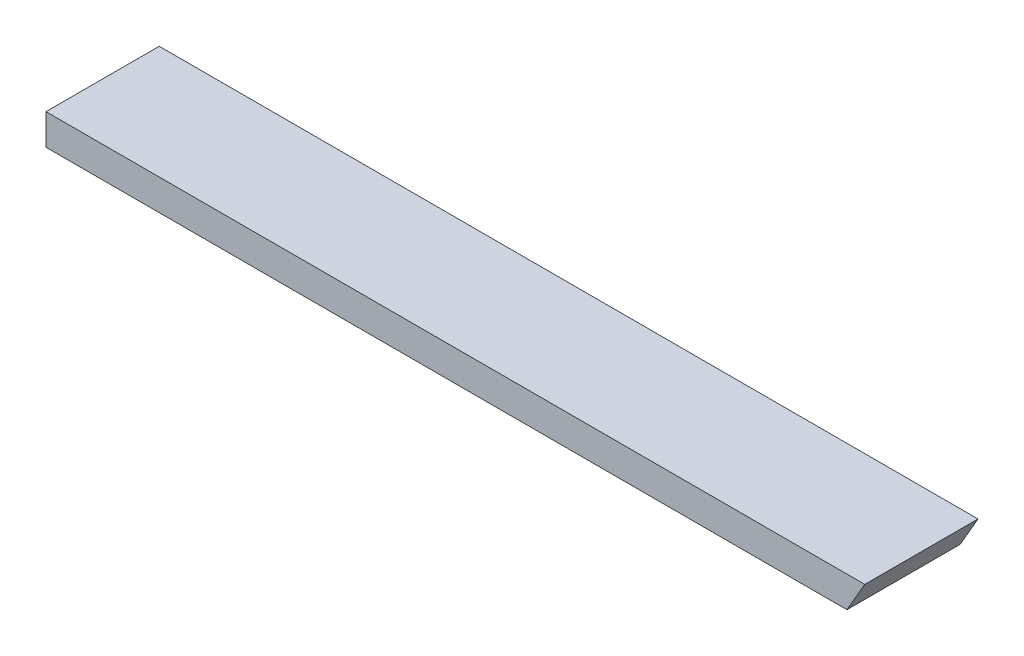
ISO-10303-21;
HEADER;
FILE_DESCRIPTION(('STEP AP214'),'2;1');
FILE_NAME('part.step','',(''),(''),'','','');
FILE_SCHEMA(('AUTOMOTIVE_DESIGN { 1 0 10303 214 1 1 1 1 }'));
ENDSEC;
DATA;
#1=APPLICATION_CONTEXT('core data for automotive mechanical design processes');
#2=APPLICATION_PROTOCOL_DEFINITION('international standard','automotive_design',2000,#1);
#3=PRODUCT_CONTEXT('',#1,'mechanical');
#4=PRODUCT('Part','Part','',(#3));
#5=PRODUCT_RELATED_PRODUCT_CATEGORY('part','',(#4));
#6=PRODUCT_DEFINITION_FORMATION('','',#4);
#7=PRODUCT_DEFINITION_CONTEXT('part definition',#1,'design');
#8=PRODUCT_DEFINITION('design','',#6,#7);
#9=PRODUCT_DEFINITION_SHAPE('','',#8);
#10=(LENGTH_UNIT() NAMED_UNIT(*) SI_UNIT(.MILLI.,.METRE.));
#11=(NAMED_UNIT(*) PLANE_ANGLE_UNIT() SI_UNIT($,.RADIAN.));
#12=(NAMED_UNIT(*) SI_UNIT($,.STERADIAN.) SOLID_ANGLE_UNIT());
#13=UNCERTAINTY_MEASURE_WITH_UNIT(LENGTH_MEASURE(1.E-05),#10,'distance_accuracy_value','');
#14=(GEOMETRIC_REPRESENTATION_CONTEXT(3) GLOBAL_UNCERTAINTY_ASSIGNED_CONTEXT((#13)) GLOBAL_UNIT_ASSIGNED_CONTEXT((#10,
#11,#12)) REPRESENTATION_CONTEXT('',''));
#15=CARTESIAN_POINT('',(0.,0.,0.));
#16=DIRECTION('',(0.,0.,1.));
#17=DIRECTION('',(1.,0.,0.));
#18=AXIS2_PLACEMENT_3D('',#15,#16,#17);
#19=CARTESIAN_POINT('',(0.,38.1,0.));
#20=DIRECTION('',(0.,0.,-1.));
#21=DIRECTION('',(-1.,0.,0.));
#22=AXIS2_PLACEMENT_3D('',#19,#20,#21);
#23=PLANE('',#22);
#24=DIRECTION('',(-0.499999999999995,-0.866025403784442,0.));
#25=VECTOR('',#24,1.);
#26=CARTESIAN_POINT('',(757.709464704918,-399.363763414906,0.));
#27=LINE('',#26,#25);
#28=CARTESIAN_POINT('',(1010.27928627322,38.1,0.));
#29=VERTEX_POINT('',#28);
#30=CARTESIAN_POINT('',(988.282241017093,0.,0.));
#31=VERTEX_POINT('',#30);
#32=EDGE_CURVE('E46',#29,#31,#27,.T.);
#33=ORIENTED_EDGE('',*,*,#32,.F.);
#34=DIRECTION('',(1.,0.,0.));
#35=VECTOR('',#34,1.);
#36=CARTESIAN_POINT('',(0.,38.1,0.));
#37=LINE('',#36,#35);
#38=CARTESIAN_POINT('',(0.,38.1,0.));
#39=VERTEX_POINT('',#38);
#40=EDGE_CURVE('E96',#39,#29,#37,.T.);
#41=ORIENTED_EDGE('',*,*,#40,.F.);
#42=DIRECTION('',(0.,-1.,0.));
#43=VECTOR('',#42,1.);
#44=CARTESIAN_POINT('',(0.,38.1,0.));
#45=LINE('',#44,#43);
#46=CARTESIAN_POINT('',(0.,0.,0.));
#47=VERTEX_POINT('',#46);
#48=EDGE_CURVE('E39',#39,#47,#45,.T.);
#49=ORIENTED_EDGE('',*,*,#48,.T.);
#50=DIRECTION('',(1.,0.,0.));
#51=VECTOR('',#50,1.);
#52=CARTESIAN_POINT('',(0.,0.,0.));
#53=LINE('',#52,#51);
#54=EDGE_CURVE('E79',#47,#31,#53,.T.);
#55=ORIENTED_EDGE('',*,*,#54,.T.);
#56=EDGE_LOOP('',(#33,#41,#49,#55));
#57=FACE_BOUND('',#56,.T.);
#58=ADVANCED_FACE('F31',(#57),#23,.F.);
#59=CARTESIAN_POINT('',(0.,38.1,-139.7));
#60=DIRECTION('',(0.,0.,1.));
#61=DIRECTION('',(1.,0.,0.));
#62=AXIS2_PLACEMENT_3D('',#59,#60,#61);
#63=PLANE('',#62);
#64=DIRECTION('',(0.499999999999995,0.866025403784442,0.));
#65=VECTOR('',#64,1.);
#66=CARTESIAN_POINT('',(757.709464704918,-399.363763414906,-139.7));
#67=LINE('',#66,#65);
#68=CARTESIAN_POINT('',(988.282241017093,0.,-139.7));
#69=VERTEX_POINT('',#68);
#70=CARTESIAN_POINT('',(1010.27928627322,38.1,-139.7));
#71=VERTEX_POINT('',#70);
#72=EDGE_CURVE('E75',#69,#71,#67,.T.);
#73=ORIENTED_EDGE('',*,*,#72,.F.);
#74=DIRECTION('',(-1.,0.,0.));
#75=VECTOR('',#74,1.);
#76=CARTESIAN_POINT('',(0.,0.,-139.7));
#77=LINE('',#76,#75);
#78=CARTESIAN_POINT('',(0.,0.,-139.7));
#79=VERTEX_POINT('',#78);
#80=EDGE_CURVE('E68',#69,#79,#77,.T.);
#81=ORIENTED_EDGE('',*,*,#80,.T.);
#82=DIRECTION('',(0.,-1.,0.));
#83=VECTOR('',#82,1.);
#84=CARTESIAN_POINT('',(0.,38.1,-139.7));
#85=LINE('',#84,#83);
#86=CARTESIAN_POINT('',(0.,38.1,-139.7));
#87=VERTEX_POINT('',#86);
#88=EDGE_CURVE('E71',#87,#79,#85,.T.);
#89=ORIENTED_EDGE('',*,*,#88,.F.);
#90=DIRECTION('',(-1.,0.,0.));
#91=VECTOR('',#90,1.);
#92=CARTESIAN_POINT('',(0.,38.1,-139.7));
#93=LINE('',#92,#91);
#94=EDGE_CURVE('E54',#71,#87,#93,.T.);
#95=ORIENTED_EDGE('',*,*,#94,.F.);
#96=EDGE_LOOP('',(#73,#81,#89,#95));
#97=FACE_BOUND('',#96,.T.);
#98=ADVANCED_FACE('F70',(#97),#63,.F.);
#99=CARTESIAN_POINT('',(0.,38.1,-139.7));
#100=DIRECTION('',(0.,-1.,0.));
#101=DIRECTION('',(0.,0.,-1.));
#102=AXIS2_PLACEMENT_3D('',#99,#100,#101);
#103=PLANE('',#102);
#104=DIRECTION('',(0.,0.,1.));
#105=VECTOR('',#104,1.);
#106=CARTESIAN_POINT('',(1010.27928627322,38.1,-1660.05316023519));
#107=LINE('',#106,#105);
#108=EDGE_CURVE('E101',#71,#29,#107,.T.);
#109=ORIENTED_EDGE('',*,*,#108,.F.);
#110=ORIENTED_EDGE('',*,*,#94,.T.);
#111=DIRECTION('',(0.,0.,1.));
#112=VECTOR('',#111,1.);
#113=CARTESIAN_POINT('',(0.,38.1,0.));
#114=LINE('',#113,#112);
#115=EDGE_CURVE('E78',#87,#39,#114,.T.);
#116=ORIENTED_EDGE('',*,*,#115,.T.);
#117=ORIENTED_EDGE('',*,*,#40,.T.);
#118=EDGE_LOOP('',(#109,#110,#116,#117));
#119=FACE_BOUND('',#118,.T.);
#120=ADVANCED_FACE('F97',(#119),#103,.F.);
#121=CARTESIAN_POINT('',(0.,0.,-139.7));
#122=DIRECTION('',(0.,-1.,0.));
#123=DIRECTION('',(0.,0.,-1.));
#124=AXIS2_PLACEMENT_3D('',#121,#122,#123);
#125=PLANE('',#124);
#126=ORIENTED_EDGE('',*,*,#80,.F.);
#127=DIRECTION('',(0.,0.,1.));
#128=VECTOR('',#127,1.);
#129=CARTESIAN_POINT('',(988.282241017093,0.,-139.7));
#130=LINE('',#129,#128);
#131=EDGE_CURVE('E11',#69,#31,#130,.T.);
#132=ORIENTED_EDGE('',*,*,#131,.T.);
#133=ORIENTED_EDGE('',*,*,#54,.F.);
#134=DIRECTION('',(0.,0.,1.));
#135=VECTOR('',#134,1.);
#136=CARTESIAN_POINT('',(0.,0.,0.));
#137=LINE('',#136,#135);
#138=EDGE_CURVE('E84',#79,#47,#137,.T.);
#139=ORIENTED_EDGE('',*,*,#138,.F.);
#140=EDGE_LOOP('',(#126,#132,#133,#139));
#141=FACE_BOUND('',#140,.T.);
#142=ADVANCED_FACE('F86',(#141),#125,.T.);
#143=CARTESIAN_POINT('',(0.,38.1,0.));
#144=DIRECTION('',(1.,0.,0.));
#145=DIRECTION('',(0.,0.,-1.));
#146=AXIS2_PLACEMENT_3D('',#143,#144,#145);
#147=PLANE('',#146);
#148=ORIENTED_EDGE('',*,*,#138,.T.);
#149=ORIENTED_EDGE('',*,*,#48,.F.);
#150=ORIENTED_EDGE('',*,*,#115,.F.);
#151=ORIENTED_EDGE('',*,*,#88,.T.);
#152=EDGE_LOOP('',(#148,#149,#150,#151));
#153=FACE_BOUND('',#152,.T.);
#154=ADVANCED_FACE('F33',(#153),#147,.F.);
#155=CARTESIAN_POINT('',(988.282241017093,0.,-1660.05316023519));
#156=DIRECTION('',(0.866025403784441,-0.499999999999995,0.));
#157=DIRECTION('',(0.499999999999995,0.866025403784442,0.));
#158=AXIS2_PLACEMENT_3D('',#155,#156,#157);
#159=PLANE('',#158);
#160=ORIENTED_EDGE('',*,*,#108,.T.);
#161=ORIENTED_EDGE('',*,*,#32,.T.);
#162=ORIENTED_EDGE('',*,*,#131,.F.);
#163=ORIENTED_EDGE('',*,*,#72,.T.);
#164=EDGE_LOOP('',(#160,#161,#162,#163));
#165=FACE_BOUND('',#164,.T.);
#166=ADVANCED_FACE('F102',(#165),#159,.T.);
#167=CLOSED_SHELL('',(#58,#98,#120,#142,#154,#166));
#168=MANIFOLD_SOLID_BREP('B2',#167);
#169=ADVANCED_BREP_SHAPE_REPRESENTATION('',(#18,#168),#14);
#170=SHAPE_DEFINITION_REPRESENTATION(#9,#169);
ENDSEC;
END-ISO-10303-21;
